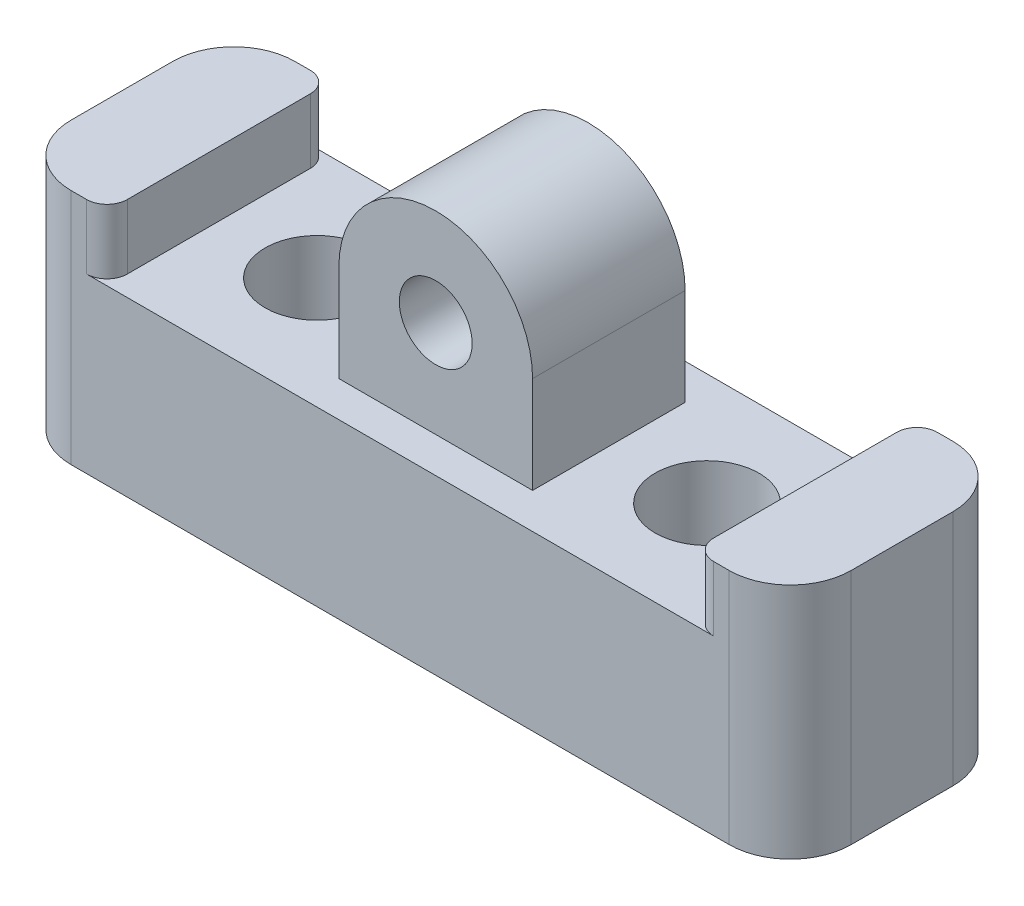
ISO-10303-21;
HEADER;
FILE_DESCRIPTION(('STEP AP214'),'2;1');
FILE_NAME('part.step','',(''),(''),'','','');
FILE_SCHEMA(('AUTOMOTIVE_DESIGN { 1 0 10303 214 1 1 1 1 }'));
ENDSEC;
DATA;
#1=APPLICATION_CONTEXT('core data for automotive mechanical design processes');
#2=APPLICATION_PROTOCOL_DEFINITION('international standard','automotive_design',2000,#1);
#3=PRODUCT_CONTEXT('',#1,'mechanical');
#4=PRODUCT('Part','Part','',(#3));
#5=PRODUCT_RELATED_PRODUCT_CATEGORY('part','',(#4));
#6=PRODUCT_DEFINITION_FORMATION('','',#4);
#7=PRODUCT_DEFINITION_CONTEXT('part definition',#1,'design');
#8=PRODUCT_DEFINITION('design','',#6,#7);
#9=PRODUCT_DEFINITION_SHAPE('','',#8);
#10=(LENGTH_UNIT() NAMED_UNIT(*) SI_UNIT(.MILLI.,.METRE.));
#11=(NAMED_UNIT(*) PLANE_ANGLE_UNIT() SI_UNIT($,.RADIAN.));
#12=(NAMED_UNIT(*) SI_UNIT($,.STERADIAN.) SOLID_ANGLE_UNIT());
#13=UNCERTAINTY_MEASURE_WITH_UNIT(LENGTH_MEASURE(1.E-05),#10,'distance_accuracy_value','');
#14=(GEOMETRIC_REPRESENTATION_CONTEXT(3) GLOBAL_UNCERTAINTY_ASSIGNED_CONTEXT((#13)) GLOBAL_UNIT_ASSIGNED_CONTEXT((#10,
#11,#12)) REPRESENTATION_CONTEXT('',''));
#15=CARTESIAN_POINT('',(0.,0.,0.));
#16=DIRECTION('',(0.,0.,1.));
#17=DIRECTION('',(1.,0.,0.));
#18=AXIS2_PLACEMENT_3D('',#15,#16,#17);
#19=CARTESIAN_POINT('',(0.,4.7625,-3.75));
#20=DIRECTION('',(0.,0.,1.));
#21=DIRECTION('',(1.,0.,0.));
#22=AXIS2_PLACEMENT_3D('',#19,#20,#21);
#23=CYLINDRICAL_SURFACE('',#22,1.7907);
#24=CARTESIAN_POINT('',(0.,4.7625,3.75));
#25=DIRECTION('',(0.,0.,1.));
#26=DIRECTION('',(1.,0.,0.));
#27=AXIS2_PLACEMENT_3D('',#24,#25,#26);
#28=CIRCLE('',#27,1.7907);
#29=CARTESIAN_POINT('',(1.7907,4.7625,3.75));
#30=VERTEX_POINT('',#29);
#31=EDGE_CURVE('E19',#30,#30,#28,.T.);
#32=ORIENTED_EDGE('',*,*,#31,.T.);
#33=EDGE_LOOP('',(#32));
#34=FACE_BOUND('',#33,.T.);
#35=CARTESIAN_POINT('',(0.,4.7625,-3.75));
#36=DIRECTION('',(0.,0.,1.));
#37=DIRECTION('',(1.,0.,0.));
#38=AXIS2_PLACEMENT_3D('',#35,#36,#37);
#39=CIRCLE('',#38,1.7907);
#40=CARTESIAN_POINT('',(1.7907,4.7625,-3.75));
#41=VERTEX_POINT('',#40);
#42=EDGE_CURVE('E172',#41,#41,#39,.T.);
#43=ORIENTED_EDGE('',*,*,#42,.F.);
#44=EDGE_LOOP('',(#43));
#45=FACE_BOUND('',#44,.T.);
#46=ADVANCED_FACE('F16',(#34,#45),#23,.F.);
#47=CARTESIAN_POINT('',(0.,4.7625,-3.75));
#48=DIRECTION('',(0.,0.,1.));
#49=DIRECTION('',(1.,0.,0.));
#50=AXIS2_PLACEMENT_3D('',#47,#48,#49);
#51=CYLINDRICAL_SURFACE('',#50,4.7625);
#52=CARTESIAN_POINT('',(0.,4.7625,-3.75));
#53=DIRECTION('',(0.,0.,1.));
#54=DIRECTION('',(1.,0.,0.));
#55=AXIS2_PLACEMENT_3D('',#52,#53,#54);
#56=CIRCLE('',#55,4.7625);
#57=CARTESIAN_POINT('',(-4.7625,4.7625,-3.75));
#58=VERTEX_POINT('',#57);
#59=CARTESIAN_POINT('',(4.7625,4.7625,-3.75));
#60=VERTEX_POINT('',#59);
#61=EDGE_CURVE('E259',#58,#60,#56,.F.);
#62=ORIENTED_EDGE('',*,*,#61,.F.);
#63=DIRECTION('',(0.,0.,1.));
#64=VECTOR('',#63,1.);
#65=CARTESIAN_POINT('',(-4.7625,4.7625,-3.75));
#66=LINE('',#65,#64);
#67=CARTESIAN_POINT('',(-4.7625,4.7625,3.75));
#68=VERTEX_POINT('',#67);
#69=EDGE_CURVE('E144',#68,#58,#66,.F.);
#70=ORIENTED_EDGE('',*,*,#69,.F.);
#71=CARTESIAN_POINT('',(0.,4.7625,3.75));
#72=DIRECTION('',(0.,0.,1.));
#73=DIRECTION('',(1.,0.,0.));
#74=AXIS2_PLACEMENT_3D('',#71,#72,#73);
#75=CIRCLE('',#74,4.7625);
#76=CARTESIAN_POINT('',(4.7625,4.7625,3.75));
#77=VERTEX_POINT('',#76);
#78=EDGE_CURVE('E147',#68,#77,#75,.F.);
#79=ORIENTED_EDGE('',*,*,#78,.T.);
#80=DIRECTION('',(0.,0.,-1.));
#81=VECTOR('',#80,1.);
#82=CARTESIAN_POINT('',(4.7625,4.7625,-3.75));
#83=LINE('',#82,#81);
#84=EDGE_CURVE('E151',#60,#77,#83,.F.);
#85=ORIENTED_EDGE('',*,*,#84,.F.);
#86=EDGE_LOOP('',(#62,#70,#79,#85));
#87=FACE_BOUND('',#86,.T.);
#88=ADVANCED_FACE('F149',(#87),#51,.T.);
#89=CARTESIAN_POINT('',(-4.7625,0.,-3.75));
#90=DIRECTION('',(-1.,0.,0.));
#91=DIRECTION('',(0.,0.,1.));
#92=AXIS2_PLACEMENT_3D('',#89,#90,#91);
#93=PLANE('',#92);
#94=DIRECTION('',(0.,1.,0.));
#95=VECTOR('',#94,1.);
#96=CARTESIAN_POINT('',(-4.7625,4.7625,-3.75));
#97=LINE('',#96,#95);
#98=CARTESIAN_POINT('',(-4.7625,0.,-3.75));
#99=VERTEX_POINT('',#98);
#100=EDGE_CURVE('E261',#99,#58,#97,.T.);
#101=ORIENTED_EDGE('',*,*,#100,.F.);
#102=DIRECTION('',(0.,0.,-1.));
#103=VECTOR('',#102,1.);
#104=CARTESIAN_POINT('',(-4.7625,0.,0.));
#105=LINE('',#104,#103);
#106=CARTESIAN_POINT('',(-4.7625,0.,3.75));
#107=VERTEX_POINT('',#106);
#108=EDGE_CURVE('E188',#99,#107,#105,.F.);
#109=ORIENTED_EDGE('',*,*,#108,.T.);
#110=DIRECTION('',(0.,1.,0.));
#111=VECTOR('',#110,1.);
#112=CARTESIAN_POINT('',(-4.7625,4.7625,3.75));
#113=LINE('',#112,#111);
#114=EDGE_CURVE('E156',#107,#68,#113,.T.);
#115=ORIENTED_EDGE('',*,*,#114,.T.);
#116=ORIENTED_EDGE('',*,*,#69,.T.);
#117=EDGE_LOOP('',(#101,#109,#115,#116));
#118=FACE_BOUND('',#117,.T.);
#119=ADVANCED_FACE('F595',(#118),#93,.T.);
#120=CARTESIAN_POINT('',(0.,4.7625,3.75));
#121=DIRECTION('',(0.,0.,-1.));
#122=DIRECTION('',(-1.,0.,0.));
#123=AXIS2_PLACEMENT_3D('',#120,#121,#122);
#124=PLANE('',#123);
#125=ORIENTED_EDGE('',*,*,#78,.F.);
#126=ORIENTED_EDGE('',*,*,#114,.F.);
#127=DIRECTION('',(1.,0.,0.));
#128=VECTOR('',#127,1.);
#129=CARTESIAN_POINT('',(0.,0.,3.75));
#130=LINE('',#129,#128);
#131=CARTESIAN_POINT('',(4.7625,0.,3.75));
#132=VERTEX_POINT('',#131);
#133=EDGE_CURVE('E163',#107,#132,#130,.T.);
#134=ORIENTED_EDGE('',*,*,#133,.T.);
#135=DIRECTION('',(0.,1.,0.));
#136=VECTOR('',#135,1.);
#137=CARTESIAN_POINT('',(4.7625,4.7625,3.75));
#138=LINE('',#137,#136);
#139=EDGE_CURVE('E155',#77,#132,#138,.F.);
#140=ORIENTED_EDGE('',*,*,#139,.F.);
#141=EDGE_LOOP('',(#125,#126,#134,#140));
#142=FACE_BOUND('',#141,.T.);
#143=ORIENTED_EDGE('',*,*,#31,.F.);
#144=EDGE_LOOP('',(#143));
#145=FACE_BOUND('',#144,.T.);
#146=ADVANCED_FACE('F159',(#142,#145),#124,.F.);
#147=CARTESIAN_POINT('',(4.7625,4.7625,-3.75));
#148=DIRECTION('',(1.,0.,0.));
#149=DIRECTION('',(0.,0.,-1.));
#150=AXIS2_PLACEMENT_3D('',#147,#148,#149);
#151=PLANE('',#150);
#152=DIRECTION('',(0.,1.,0.));
#153=VECTOR('',#152,1.);
#154=CARTESIAN_POINT('',(4.7625,4.7625,-3.75));
#155=LINE('',#154,#153);
#156=CARTESIAN_POINT('',(4.7625,0.,-3.75));
#157=VERTEX_POINT('',#156);
#158=EDGE_CURVE('E170',#60,#157,#155,.F.);
#159=ORIENTED_EDGE('',*,*,#158,.F.);
#160=ORIENTED_EDGE('',*,*,#84,.T.);
#161=ORIENTED_EDGE('',*,*,#139,.T.);
#162=DIRECTION('',(0.,0.,-1.));
#163=VECTOR('',#162,1.);
#164=CARTESIAN_POINT('',(4.7625,0.,0.));
#165=LINE('',#164,#163);
#166=EDGE_CURVE('E180',#132,#157,#165,.T.);
#167=ORIENTED_EDGE('',*,*,#166,.T.);
#168=EDGE_LOOP('',(#159,#160,#161,#167));
#169=FACE_BOUND('',#168,.T.);
#170=ADVANCED_FACE('F168',(#169),#151,.T.);
#171=CARTESIAN_POINT('',(0.,4.7625,-3.75));
#172=DIRECTION('',(0.,0.,-1.));
#173=DIRECTION('',(-1.,0.,0.));
#174=AXIS2_PLACEMENT_3D('',#171,#172,#173);
#175=PLANE('',#174);
#176=ORIENTED_EDGE('',*,*,#100,.T.);
#177=ORIENTED_EDGE('',*,*,#61,.T.);
#178=ORIENTED_EDGE('',*,*,#158,.T.);
#179=DIRECTION('',(1.,0.,0.));
#180=VECTOR('',#179,1.);
#181=CARTESIAN_POINT('',(0.,0.,-3.75));
#182=LINE('',#181,#180);
#183=EDGE_CURVE('E182',#157,#99,#182,.F.);
#184=ORIENTED_EDGE('',*,*,#183,.T.);
#185=EDGE_LOOP('',(#176,#177,#178,#184));
#186=FACE_BOUND('',#185,.T.);
#187=ORIENTED_EDGE('',*,*,#42,.T.);
#188=EDGE_LOOP('',(#187));
#189=FACE_BOUND('',#188,.T.);
#190=ADVANCED_FACE('F573',(#186,#189),#175,.T.);
#191=CARTESIAN_POINT('',(14.4145,18.3367179098367,5.5));
#192=DIRECTION('',(-1.,0.,0.));
#193=DIRECTION('',(0.,0.,1.));
#194=AXIS2_PLACEMENT_3D('',#191,#192,#193);
#195=PLANE('',#194);
#196=DIRECTION('',(0.,0.,-1.));
#197=VECTOR('',#196,1.);
#198=CARTESIAN_POINT('',(14.4145,0.,0.));
#199=LINE('',#198,#197);
#200=CARTESIAN_POINT('',(14.4145,0.,-4.499999968));
#201=VERTEX_POINT('',#200);
#202=CARTESIAN_POINT('',(14.4145,0.,4.499999968));
#203=VERTEX_POINT('',#202);
#204=EDGE_CURVE('E239',#201,#203,#199,.F.);
#205=ORIENTED_EDGE('',*,*,#204,.T.);
#206=DIRECTION('',(0.,1.,0.));
#207=VECTOR('',#206,1.);
#208=CARTESIAN_POINT('',(14.4145,-8.5,4.499999968));
#209=LINE('',#208,#207);
#210=CARTESIAN_POINT('',(14.4145,3.175,4.499999968));
#211=VERTEX_POINT('',#210);
#212=EDGE_CURVE('E251',#211,#203,#209,.F.);
#213=ORIENTED_EDGE('',*,*,#212,.F.);
#214=DIRECTION('',(0.,0.,-1.));
#215=VECTOR('',#214,1.);
#216=CARTESIAN_POINT('',(14.4145,3.175,0.));
#217=LINE('',#216,#215);
#218=CARTESIAN_POINT('',(14.4145,3.175,-4.499999968));
#219=VERTEX_POINT('',#218);
#220=EDGE_CURVE('E258',#211,#219,#217,.T.);
#221=ORIENTED_EDGE('',*,*,#220,.T.);
#222=DIRECTION('',(0.,1.,0.));
#223=VECTOR('',#222,1.);
#224=CARTESIAN_POINT('',(14.4145,18.3367179098367,-4.499999968));
#225=LINE('',#224,#223);
#226=EDGE_CURVE('E260',#201,#219,#225,.T.);
#227=ORIENTED_EDGE('',*,*,#226,.F.);
#228=EDGE_LOOP('',(#205,#213,#221,#227));
#229=FACE_BOUND('',#228,.T.);
#230=ADVANCED_FACE('F345',(#229),#195,.T.);
#231=CARTESIAN_POINT('',(-14.4145,18.3367179098367,5.5));
#232=DIRECTION('',(1.,0.,0.));
#233=DIRECTION('',(0.,0.,-1.));
#234=AXIS2_PLACEMENT_3D('',#231,#232,#233);
#235=PLANE('',#234);
#236=DIRECTION('',(0.,0.,-1.));
#237=VECTOR('',#236,1.);
#238=CARTESIAN_POINT('',(-14.4145,3.175,0.));
#239=LINE('',#238,#237);
#240=CARTESIAN_POINT('',(-14.4145,3.175,-4.499999968));
#241=VERTEX_POINT('',#240);
#242=CARTESIAN_POINT('',(-14.4145,3.175,4.499999968));
#243=VERTEX_POINT('',#242);
#244=EDGE_CURVE('E248',#241,#243,#239,.F.);
#245=ORIENTED_EDGE('',*,*,#244,.T.);
#246=DIRECTION('',(0.,1.,0.));
#247=VECTOR('',#246,1.);
#248=CARTESIAN_POINT('',(-14.4145,18.3367179098367,4.499999968));
#249=LINE('',#248,#247);
#250=CARTESIAN_POINT('',(-14.4145,0.,4.499999968));
#251=VERTEX_POINT('',#250);
#252=EDGE_CURVE('E255',#251,#243,#249,.T.);
#253=ORIENTED_EDGE('',*,*,#252,.F.);
#254=DIRECTION('',(0.,0.,-1.));
#255=VECTOR('',#254,1.);
#256=CARTESIAN_POINT('',(-14.4145,0.,0.));
#257=LINE('',#256,#255);
#258=CARTESIAN_POINT('',(-14.4145,0.,-4.499999968));
#259=VERTEX_POINT('',#258);
#260=EDGE_CURVE('E233',#251,#259,#257,.T.);
#261=ORIENTED_EDGE('',*,*,#260,.T.);
#262=DIRECTION('',(0.,1.,0.));
#263=VECTOR('',#262,1.);
#264=CARTESIAN_POINT('',(-14.4145,-8.5,-4.499999968));
#265=LINE('',#264,#263);
#266=EDGE_CURVE('E265',#241,#259,#265,.F.);
#267=ORIENTED_EDGE('',*,*,#266,.F.);
#268=EDGE_LOOP('',(#245,#253,#261,#267));
#269=FACE_BOUND('',#268,.T.);
#270=ADVANCED_FACE('F366',(#269),#235,.T.);
#271=CARTESIAN_POINT('',(15.414500032,18.3367179098367,-4.499999968));
#272=DIRECTION('',(0.,1.,0.));
#273=DIRECTION('',(0.,0.,1.));
#274=AXIS2_PLACEMENT_3D('',#271,#272,#273);
#275=CYLINDRICAL_SURFACE('',#274,1.000000032);
#276=CARTESIAN_POINT('',(15.414500032,0.,-4.499999968));
#277=DIRECTION('',(0.,1.,0.));
#278=DIRECTION('',(0.,0.,1.));
#279=AXIS2_PLACEMENT_3D('',#276,#277,#278);
#280=CIRCLE('',#279,1.000000032);
#281=CARTESIAN_POINT('',(15.414500032,0.,-5.5));
#282=VERTEX_POINT('',#281);
#283=EDGE_CURVE('E240',#282,#201,#280,.T.);
#284=ORIENTED_EDGE('',*,*,#283,.T.);
#285=ORIENTED_EDGE('',*,*,#226,.T.);
#286=CARTESIAN_POINT('',(15.414500032,3.175,-4.499999968));
#287=DIRECTION('',(0.,1.,0.));
#288=DIRECTION('',(0.,0.,1.));
#289=AXIS2_PLACEMENT_3D('',#286,#287,#288);
#290=CIRCLE('',#289,1.000000032);
#291=CARTESIAN_POINT('',(15.414500032,3.175,-5.5));
#292=VERTEX_POINT('',#291);
#293=EDGE_CURVE('E256',#219,#292,#290,.F.);
#294=ORIENTED_EDGE('',*,*,#293,.T.);
#295=DIRECTION('',(0.,1.,0.));
#296=VECTOR('',#295,1.);
#297=CARTESIAN_POINT('',(15.414500032,-8.5,-5.5));
#298=LINE('',#297,#296);
#299=EDGE_CURVE('E311',#292,#282,#298,.F.);
#300=ORIENTED_EDGE('',*,*,#299,.T.);
#301=EDGE_LOOP('',(#284,#285,#294,#300));
#302=FACE_BOUND('',#301,.T.);
#303=ADVANCED_FACE('F347',(#302),#275,.T.);
#304=CARTESIAN_POINT('',(-15.414500032,-8.5,-4.499999968));
#305=DIRECTION('',(0.,1.,0.));
#306=DIRECTION('',(0.,0.,1.));
#307=AXIS2_PLACEMENT_3D('',#304,#305,#306);
#308=CYLINDRICAL_SURFACE('',#307,1.000000032);
#309=CARTESIAN_POINT('',(-15.414500032,0.,-4.499999968));
#310=DIRECTION('',(0.,1.,0.));
#311=DIRECTION('',(0.,0.,1.));
#312=AXIS2_PLACEMENT_3D('',#309,#310,#311);
#313=CIRCLE('',#312,1.000000032);
#314=CARTESIAN_POINT('',(-15.414500032,0.,-5.5));
#315=VERTEX_POINT('',#314);
#316=EDGE_CURVE('E243',#259,#315,#313,.T.);
#317=ORIENTED_EDGE('',*,*,#316,.T.);
#318=DIRECTION('',(0.,1.,0.));
#319=VECTOR('',#318,1.);
#320=CARTESIAN_POINT('',(-15.414500032,-8.5,-5.5));
#321=LINE('',#320,#319);
#322=CARTESIAN_POINT('',(-15.414500032,3.175,-5.5));
#323=VERTEX_POINT('',#322);
#324=EDGE_CURVE('E313',#315,#323,#321,.T.);
#325=ORIENTED_EDGE('',*,*,#324,.T.);
#326=CARTESIAN_POINT('',(-15.414500032,3.175,-4.499999968));
#327=DIRECTION('',(0.,1.,0.));
#328=DIRECTION('',(0.,0.,1.));
#329=AXIS2_PLACEMENT_3D('',#326,#327,#328);
#330=CIRCLE('',#329,1.000000032);
#331=EDGE_CURVE('E245',#323,#241,#330,.F.);
#332=ORIENTED_EDGE('',*,*,#331,.T.);
#333=ORIENTED_EDGE('',*,*,#266,.T.);
#334=EDGE_LOOP('',(#317,#325,#332,#333));
#335=FACE_BOUND('',#334,.T.);
#336=ADVANCED_FACE('F359',(#335),#308,.T.);
#337=CARTESIAN_POINT('',(0.,3.175,0.));
#338=DIRECTION('',(0.,-1.,0.));
#339=DIRECTION('',(0.,0.,-1.));
#340=AXIS2_PLACEMENT_3D('',#337,#338,#339);
#341=PLANE('',#340);
#342=ORIENTED_EDGE('',*,*,#293,.F.);
#343=ORIENTED_EDGE('',*,*,#220,.F.);
#344=CARTESIAN_POINT('',(15.414500032,3.175,4.499999968));
#345=DIRECTION('',(0.,1.,0.));
#346=DIRECTION('',(0.,0.,1.));
#347=AXIS2_PLACEMENT_3D('',#344,#345,#346);
#348=CIRCLE('',#347,1.000000032);
#349=CARTESIAN_POINT('',(15.414500032,3.175,5.5));
#350=VERTEX_POINT('',#349);
#351=EDGE_CURVE('E252',#350,#211,#348,.F.);
#352=ORIENTED_EDGE('',*,*,#351,.F.);
#353=DIRECTION('',(1.,0.,0.));
#354=VECTOR('',#353,1.);
#355=CARTESIAN_POINT('',(0.,3.175,5.5));
#356=LINE('',#355,#354);
#357=CARTESIAN_POINT('',(16.177,3.175,5.5));
#358=VERTEX_POINT('',#357);
#359=EDGE_CURVE('E306',#358,#350,#356,.F.);
#360=ORIENTED_EDGE('',*,*,#359,.F.);
#361=CARTESIAN_POINT('',(16.177,3.175,2.5));
#362=DIRECTION('',(0.,1.,0.));
#363=DIRECTION('',(0.,0.,1.));
#364=AXIS2_PLACEMENT_3D('',#361,#362,#363);
#365=CIRCLE('',#364,3.);
#366=CARTESIAN_POINT('',(19.177,3.175,2.5));
#367=VERTEX_POINT('',#366);
#368=EDGE_CURVE('E217',#367,#358,#365,.F.);
#369=ORIENTED_EDGE('',*,*,#368,.F.);
#370=DIRECTION('',(0.,0.,-1.));
#371=VECTOR('',#370,1.);
#372=CARTESIAN_POINT('',(19.177,3.175,5.5));
#373=LINE('',#372,#371);
#374=CARTESIAN_POINT('',(19.177,3.175,-2.5));
#375=VERTEX_POINT('',#374);
#376=EDGE_CURVE('E221',#375,#367,#373,.F.);
#377=ORIENTED_EDGE('',*,*,#376,.F.);
#378=CARTESIAN_POINT('',(16.177,3.175,-2.5));
#379=DIRECTION('',(0.,1.,0.));
#380=DIRECTION('',(0.,0.,1.));
#381=AXIS2_PLACEMENT_3D('',#378,#379,#380);
#382=CIRCLE('',#381,3.);
#383=CARTESIAN_POINT('',(16.177,3.175,-5.5));
#384=VERTEX_POINT('',#383);
#385=EDGE_CURVE('E222',#384,#375,#382,.F.);
#386=ORIENTED_EDGE('',*,*,#385,.F.);
#387=DIRECTION('',(1.,0.,0.));
#388=VECTOR('',#387,1.);
#389=CARTESIAN_POINT('',(14.4145,3.175,-5.5));
#390=LINE('',#389,#388);
#391=EDGE_CURVE('E308',#384,#292,#390,.F.);
#392=ORIENTED_EDGE('',*,*,#391,.T.);
#393=EDGE_LOOP('',(#342,#343,#352,#360,#369,#377,#386,#392));
#394=FACE_BOUND('',#393,.T.);
#395=ADVANCED_FACE('F344',(#394),#341,.F.);
#396=CARTESIAN_POINT('',(-15.414500032,18.3367179098367,4.499999968));
#397=DIRECTION('',(0.,1.,0.));
#398=DIRECTION('',(0.,0.,1.));
#399=AXIS2_PLACEMENT_3D('',#396,#397,#398);
#400=CYLINDRICAL_SURFACE('',#399,1.000000032);
#401=CARTESIAN_POINT('',(-15.414500032,0.,4.499999968));
#402=DIRECTION('',(0.,1.,0.));
#403=DIRECTION('',(0.,0.,1.));
#404=AXIS2_PLACEMENT_3D('',#401,#402,#403);
#405=CIRCLE('',#404,1.000000032);
#406=CARTESIAN_POINT('',(-15.414500032,0.,5.5));
#407=VERTEX_POINT('',#406);
#408=EDGE_CURVE('E234',#407,#251,#405,.T.);
#409=ORIENTED_EDGE('',*,*,#408,.T.);
#410=ORIENTED_EDGE('',*,*,#252,.T.);
#411=CARTESIAN_POINT('',(-15.414500032,3.175,4.499999968));
#412=DIRECTION('',(0.,1.,0.));
#413=DIRECTION('',(0.,0.,1.));
#414=AXIS2_PLACEMENT_3D('',#411,#412,#413);
#415=CIRCLE('',#414,1.000000032);
#416=CARTESIAN_POINT('',(-15.414500032,3.175,5.5));
#417=VERTEX_POINT('',#416);
#418=EDGE_CURVE('E249',#243,#417,#415,.F.);
#419=ORIENTED_EDGE('',*,*,#418,.T.);
#420=DIRECTION('',(0.,1.,0.));
#421=VECTOR('',#420,1.);
#422=CARTESIAN_POINT('',(-15.414500032,-8.5,5.5));
#423=LINE('',#422,#421);
#424=EDGE_CURVE('E294',#417,#407,#423,.F.);
#425=ORIENTED_EDGE('',*,*,#424,.T.);
#426=EDGE_LOOP('',(#409,#410,#419,#425));
#427=FACE_BOUND('',#426,.T.);
#428=ADVANCED_FACE('F364',(#427),#400,.T.);
#429=CARTESIAN_POINT('',(15.414500032,-8.5,4.499999968));
#430=DIRECTION('',(0.,1.,0.));
#431=DIRECTION('',(0.,0.,1.));
#432=AXIS2_PLACEMENT_3D('',#429,#430,#431);
#433=CYLINDRICAL_SURFACE('',#432,1.000000032);
#434=CARTESIAN_POINT('',(15.414500032,0.,4.499999968));
#435=DIRECTION('',(0.,1.,0.));
#436=DIRECTION('',(0.,0.,1.));
#437=AXIS2_PLACEMENT_3D('',#434,#435,#436);
#438=CIRCLE('',#437,1.000000032);
#439=CARTESIAN_POINT('',(15.414500032,0.,5.5));
#440=VERTEX_POINT('',#439);
#441=EDGE_CURVE('E237',#203,#440,#438,.T.);
#442=ORIENTED_EDGE('',*,*,#441,.T.);
#443=DIRECTION('',(0.,1.,0.));
#444=VECTOR('',#443,1.);
#445=CARTESIAN_POINT('',(15.414500032,-8.5,5.5));
#446=LINE('',#445,#444);
#447=EDGE_CURVE('E216',#440,#350,#446,.T.);
#448=ORIENTED_EDGE('',*,*,#447,.T.);
#449=ORIENTED_EDGE('',*,*,#351,.T.);
#450=ORIENTED_EDGE('',*,*,#212,.T.);
#451=EDGE_LOOP('',(#442,#448,#449,#450));
#452=FACE_BOUND('',#451,.T.);
#453=ADVANCED_FACE('F326',(#452),#433,.T.);
#454=CARTESIAN_POINT('',(0.,3.175,0.));
#455=DIRECTION('',(0.,-1.,0.));
#456=DIRECTION('',(0.,0.,-1.));
#457=AXIS2_PLACEMENT_3D('',#454,#455,#456);
#458=PLANE('',#457);
#459=ORIENTED_EDGE('',*,*,#331,.F.);
#460=DIRECTION('',(1.,0.,0.));
#461=VECTOR('',#460,1.);
#462=CARTESIAN_POINT('',(14.4145,3.175,-5.5));
#463=LINE('',#462,#461);
#464=CARTESIAN_POINT('',(-16.177,3.175,-5.5));
#465=VERTEX_POINT('',#464);
#466=EDGE_CURVE('E225',#323,#465,#463,.F.);
#467=ORIENTED_EDGE('',*,*,#466,.T.);
#468=CARTESIAN_POINT('',(-16.177,3.175,-2.5));
#469=DIRECTION('',(0.,1.,0.));
#470=DIRECTION('',(0.,0.,1.));
#471=AXIS2_PLACEMENT_3D('',#468,#469,#470);
#472=CIRCLE('',#471,3.);
#473=CARTESIAN_POINT('',(-19.177,3.175,-2.5));
#474=VERTEX_POINT('',#473);
#475=EDGE_CURVE('E226',#474,#465,#472,.F.);
#476=ORIENTED_EDGE('',*,*,#475,.F.);
#477=DIRECTION('',(0.,0.,1.));
#478=VECTOR('',#477,1.);
#479=CARTESIAN_POINT('',(-19.177,3.175,5.5));
#480=LINE('',#479,#478);
#481=CARTESIAN_POINT('',(-19.177,3.175,2.5));
#482=VERTEX_POINT('',#481);
#483=EDGE_CURVE('E229',#482,#474,#480,.F.);
#484=ORIENTED_EDGE('',*,*,#483,.F.);
#485=CARTESIAN_POINT('',(-16.177,3.175,2.5));
#486=DIRECTION('',(0.,1.,0.));
#487=DIRECTION('',(0.,0.,1.));
#488=AXIS2_PLACEMENT_3D('',#485,#486,#487);
#489=CIRCLE('',#488,3.);
#490=CARTESIAN_POINT('',(-16.177,3.175,5.5));
#491=VERTEX_POINT('',#490);
#492=EDGE_CURVE('E212',#491,#482,#489,.F.);
#493=ORIENTED_EDGE('',*,*,#492,.F.);
#494=DIRECTION('',(-1.,0.,0.));
#495=VECTOR('',#494,1.);
#496=CARTESIAN_POINT('',(14.4145,3.175,5.5));
#497=LINE('',#496,#495);
#498=EDGE_CURVE('E297',#491,#417,#497,.F.);
#499=ORIENTED_EDGE('',*,*,#498,.T.);
#500=ORIENTED_EDGE('',*,*,#418,.F.);
#501=ORIENTED_EDGE('',*,*,#244,.F.);
#502=EDGE_LOOP('',(#459,#467,#476,#484,#493,#499,#500,#501));
#503=FACE_BOUND('',#502,.T.);
#504=ADVANCED_FACE('F361',(#503),#458,.F.);
#505=CARTESIAN_POINT('',(0.,0.,0.));
#506=DIRECTION('',(0.,-1.,0.));
#507=DIRECTION('',(0.,0.,-1.));
#508=AXIS2_PLACEMENT_3D('',#505,#506,#507);
#509=PLANE('',#508);
#510=CARTESIAN_POINT('',(9.5885,0.,0.));
#511=DIRECTION('',(0.,1.,0.));
#512=DIRECTION('',(0.,0.,1.));
#513=AXIS2_PLACEMENT_3D('',#510,#511,#512);
#514=CIRCLE('',#513,2.5527);
#515=CARTESIAN_POINT('',(9.5885,0.,2.5527));
#516=VERTEX_POINT('',#515);
#517=EDGE_CURVE('E209',#516,#516,#514,.F.);
#518=ORIENTED_EDGE('',*,*,#517,.T.);
#519=EDGE_LOOP('',(#518));
#520=FACE_BOUND('',#519,.T.);
#521=CARTESIAN_POINT('',(-9.5885,0.,0.));
#522=DIRECTION('',(0.,1.,0.));
#523=DIRECTION('',(0.,0.,1.));
#524=AXIS2_PLACEMENT_3D('',#521,#522,#523);
#525=CIRCLE('',#524,2.5527);
#526=CARTESIAN_POINT('',(-9.5885,0.,2.55269999999999));
#527=VERTEX_POINT('',#526);
#528=EDGE_CURVE('E230',#527,#527,#525,.F.);
#529=ORIENTED_EDGE('',*,*,#528,.T.);
#530=EDGE_LOOP('',(#529));
#531=FACE_BOUND('',#530,.T.);
#532=ORIENTED_EDGE('',*,*,#408,.F.);
#533=DIRECTION('',(-1.,0.,0.));
#534=VECTOR('',#533,1.);
#535=CARTESIAN_POINT('',(14.4145,0.,5.5));
#536=LINE('',#535,#534);
#537=EDGE_CURVE('E296',#407,#440,#536,.F.);
#538=ORIENTED_EDGE('',*,*,#537,.T.);
#539=ORIENTED_EDGE('',*,*,#441,.F.);
#540=ORIENTED_EDGE('',*,*,#204,.F.);
#541=ORIENTED_EDGE('',*,*,#283,.F.);
#542=DIRECTION('',(1.,0.,0.));
#543=VECTOR('',#542,1.);
#544=CARTESIAN_POINT('',(14.4145,0.,-5.5));
#545=LINE('',#544,#543);
#546=EDGE_CURVE('E315',#282,#315,#545,.F.);
#547=ORIENTED_EDGE('',*,*,#546,.T.);
#548=ORIENTED_EDGE('',*,*,#316,.F.);
#549=ORIENTED_EDGE('',*,*,#260,.F.);
#550=EDGE_LOOP('',(#532,#538,#539,#540,#541,#547,#548,#549));
#551=FACE_BOUND('',#550,.T.);
#552=ORIENTED_EDGE('',*,*,#166,.F.);
#553=ORIENTED_EDGE('',*,*,#133,.F.);
#554=ORIENTED_EDGE('',*,*,#108,.F.);
#555=ORIENTED_EDGE('',*,*,#183,.F.);
#556=EDGE_LOOP('',(#552,#553,#554,#555));
#557=FACE_BOUND('',#556,.T.);
#558=ADVANCED_FACE('F332',(#520,#531,#551,#557),#509,.F.);
#559=CARTESIAN_POINT('',(-9.5885,-8.5,0.));
#560=DIRECTION('',(0.,1.,0.));
#561=DIRECTION('',(0.,0.,1.));
#562=AXIS2_PLACEMENT_3D('',#559,#560,#561);
#563=CYLINDRICAL_SURFACE('',#562,2.5527);
#564=CARTESIAN_POINT('',(-9.5885,-8.5,0.));
#565=DIRECTION('',(0.,1.,0.));
#566=DIRECTION('',(0.,0.,1.));
#567=AXIS2_PLACEMENT_3D('',#564,#565,#566);
#568=CIRCLE('',#567,2.5527);
#569=CARTESIAN_POINT('',(-9.5885,-8.5,2.55269999999999));
#570=VERTEX_POINT('',#569);
#571=EDGE_CURVE('E206',#570,#570,#568,.T.);
#572=ORIENTED_EDGE('',*,*,#571,.F.);
#573=EDGE_LOOP('',(#572));
#574=FACE_BOUND('',#573,.T.);
#575=ORIENTED_EDGE('',*,*,#528,.F.);
#576=EDGE_LOOP('',(#575));
#577=FACE_BOUND('',#576,.T.);
#578=ADVANCED_FACE('F500',(#574,#577),#563,.F.);
#579=CARTESIAN_POINT('',(-19.177,18.3367179098367,5.5));
#580=DIRECTION('',(-1.,0.,0.));
#581=DIRECTION('',(0.,0.,1.));
#582=AXIS2_PLACEMENT_3D('',#579,#580,#581);
#583=PLANE('',#582);
#584=DIRECTION('',(0.,0.,-1.));
#585=VECTOR('',#584,1.);
#586=CARTESIAN_POINT('',(-19.177,-8.5,0.));
#587=LINE('',#586,#585);
#588=CARTESIAN_POINT('',(-19.177,-8.5,2.5));
#589=VERTEX_POINT('',#588);
#590=CARTESIAN_POINT('',(-19.177,-8.5,-2.5));
#591=VERTEX_POINT('',#590);
#592=EDGE_CURVE('E205',#589,#591,#587,.T.);
#593=ORIENTED_EDGE('',*,*,#592,.F.);
#594=DIRECTION('',(0.,1.,0.));
#595=VECTOR('',#594,1.);
#596=CARTESIAN_POINT('',(-19.177,-8.5,2.5));
#597=LINE('',#596,#595);
#598=EDGE_CURVE('E215',#482,#589,#597,.F.);
#599=ORIENTED_EDGE('',*,*,#598,.F.);
#600=ORIENTED_EDGE('',*,*,#483,.T.);
#601=DIRECTION('',(0.,1.,0.));
#602=VECTOR('',#601,1.);
#603=CARTESIAN_POINT('',(-19.177,18.3367179098367,-2.5));
#604=LINE('',#603,#602);
#605=EDGE_CURVE('E228',#591,#474,#604,.T.);
#606=ORIENTED_EDGE('',*,*,#605,.F.);
#607=EDGE_LOOP('',(#593,#599,#600,#606));
#608=FACE_BOUND('',#607,.T.);
#609=ADVANCED_FACE('F390',(#608),#583,.T.);
#610=CARTESIAN_POINT('',(-16.177,18.3367179098367,-2.5));
#611=DIRECTION('',(0.,1.,0.));
#612=DIRECTION('',(0.,0.,1.));
#613=AXIS2_PLACEMENT_3D('',#610,#611,#612);
#614=CYLINDRICAL_SURFACE('',#613,3.);
#615=CARTESIAN_POINT('',(-16.177,-8.5,-2.5));
#616=DIRECTION('',(0.,1.,0.));
#617=DIRECTION('',(0.,0.,1.));
#618=AXIS2_PLACEMENT_3D('',#615,#616,#617);
#619=CIRCLE('',#618,3.);
#620=CARTESIAN_POINT('',(-16.177,-8.5,-5.5));
#621=VERTEX_POINT('',#620);
#622=EDGE_CURVE('E202',#591,#621,#619,.F.);
#623=ORIENTED_EDGE('',*,*,#622,.F.);
#624=ORIENTED_EDGE('',*,*,#605,.T.);
#625=ORIENTED_EDGE('',*,*,#475,.T.);
#626=DIRECTION('',(0.,1.,0.));
#627=VECTOR('',#626,1.);
#628=CARTESIAN_POINT('',(-16.177,-8.5,-5.5));
#629=LINE('',#628,#627);
#630=EDGE_CURVE('E312',#465,#621,#629,.F.);
#631=ORIENTED_EDGE('',*,*,#630,.T.);
#632=EDGE_LOOP('',(#623,#624,#625,#631));
#633=FACE_BOUND('',#632,.T.);
#634=ADVANCED_FACE('F386',(#633),#614,.T.);
#635=CARTESIAN_POINT('',(14.4145,-8.5,-5.5));
#636=DIRECTION('',(0.,0.,1.));
#637=DIRECTION('',(1.,0.,0.));
#638=AXIS2_PLACEMENT_3D('',#635,#636,#637);
#639=PLANE('',#638);
#640=ORIENTED_EDGE('',*,*,#324,.F.);
#641=ORIENTED_EDGE('',*,*,#546,.F.);
#642=ORIENTED_EDGE('',*,*,#299,.F.);
#643=ORIENTED_EDGE('',*,*,#391,.F.);
#644=DIRECTION('',(0.,1.,0.));
#645=VECTOR('',#644,1.);
#646=CARTESIAN_POINT('',(16.177,-8.5,-5.5));
#647=LINE('',#646,#645);
#648=CARTESIAN_POINT('',(16.177,-8.5,-5.5));
#649=VERTEX_POINT('',#648);
#650=EDGE_CURVE('E224',#649,#384,#647,.T.);
#651=ORIENTED_EDGE('',*,*,#650,.F.);
#652=DIRECTION('',(1.,0.,0.));
#653=VECTOR('',#652,1.);
#654=CARTESIAN_POINT('',(0.,-8.5,-5.5));
#655=LINE('',#654,#653);
#656=EDGE_CURVE('E201',#621,#649,#655,.T.);
#657=ORIENTED_EDGE('',*,*,#656,.F.);
#658=ORIENTED_EDGE('',*,*,#630,.F.);
#659=ORIENTED_EDGE('',*,*,#466,.F.);
#660=EDGE_LOOP('',(#640,#641,#642,#643,#651,#657,#658,#659));
#661=FACE_BOUND('',#660,.T.);
#662=ADVANCED_FACE('F353',(#661),#639,.F.);
#663=CARTESIAN_POINT('',(16.177,-8.5,-2.5));
#664=DIRECTION('',(0.,1.,0.));
#665=DIRECTION('',(0.,0.,1.));
#666=AXIS2_PLACEMENT_3D('',#663,#664,#665);
#667=CYLINDRICAL_SURFACE('',#666,3.);
#668=CARTESIAN_POINT('',(16.177,-8.5,-2.5));
#669=DIRECTION('',(0.,1.,0.));
#670=DIRECTION('',(0.,0.,1.));
#671=AXIS2_PLACEMENT_3D('',#668,#669,#670);
#672=CIRCLE('',#671,3.);
#673=CARTESIAN_POINT('',(19.177,-8.5,-2.5));
#674=VERTEX_POINT('',#673);
#675=EDGE_CURVE('E198',#649,#674,#672,.F.);
#676=ORIENTED_EDGE('',*,*,#675,.F.);
#677=ORIENTED_EDGE('',*,*,#650,.T.);
#678=ORIENTED_EDGE('',*,*,#385,.T.);
#679=DIRECTION('',(0.,1.,0.));
#680=VECTOR('',#679,1.);
#681=CARTESIAN_POINT('',(19.177,18.3367179098367,-2.5));
#682=LINE('',#681,#680);
#683=EDGE_CURVE('E304',#674,#375,#682,.T.);
#684=ORIENTED_EDGE('',*,*,#683,.F.);
#685=EDGE_LOOP('',(#676,#677,#678,#684));
#686=FACE_BOUND('',#685,.T.);
#687=ADVANCED_FACE('F412',(#686),#667,.T.);
#688=CARTESIAN_POINT('',(19.177,18.3367179098367,5.5));
#689=DIRECTION('',(1.,0.,0.));
#690=DIRECTION('',(0.,0.,-1.));
#691=AXIS2_PLACEMENT_3D('',#688,#689,#690);
#692=PLANE('',#691);
#693=ORIENTED_EDGE('',*,*,#376,.T.);
#694=DIRECTION('',(0.,1.,0.));
#695=VECTOR('',#694,1.);
#696=CARTESIAN_POINT('',(19.177,18.3367179098367,2.5));
#697=LINE('',#696,#695);
#698=CARTESIAN_POINT('',(19.177,-8.5,2.5));
#699=VERTEX_POINT('',#698);
#700=EDGE_CURVE('E220',#699,#367,#697,.T.);
#701=ORIENTED_EDGE('',*,*,#700,.F.);
#702=DIRECTION('',(0.,0.,-1.));
#703=VECTOR('',#702,1.);
#704=CARTESIAN_POINT('',(19.177,-8.5,0.));
#705=LINE('',#704,#703);
#706=EDGE_CURVE('E197',#674,#699,#705,.F.);
#707=ORIENTED_EDGE('',*,*,#706,.F.);
#708=ORIENTED_EDGE('',*,*,#683,.T.);
#709=EDGE_LOOP('',(#693,#701,#707,#708));
#710=FACE_BOUND('',#709,.T.);
#711=ADVANCED_FACE('F408',(#710),#692,.T.);
#712=CARTESIAN_POINT('',(16.177,18.3367179098367,2.5));
#713=DIRECTION('',(0.,1.,0.));
#714=DIRECTION('',(0.,0.,1.));
#715=AXIS2_PLACEMENT_3D('',#712,#713,#714);
#716=CYLINDRICAL_SURFACE('',#715,3.);
#717=CARTESIAN_POINT('',(16.177,-8.5,2.5));
#718=DIRECTION('',(0.,1.,0.));
#719=DIRECTION('',(0.,0.,1.));
#720=AXIS2_PLACEMENT_3D('',#717,#718,#719);
#721=CIRCLE('',#720,3.);
#722=CARTESIAN_POINT('',(16.177,-8.5,5.5));
#723=VERTEX_POINT('',#722);
#724=EDGE_CURVE('E194',#699,#723,#721,.F.);
#725=ORIENTED_EDGE('',*,*,#724,.F.);
#726=ORIENTED_EDGE('',*,*,#700,.T.);
#727=ORIENTED_EDGE('',*,*,#368,.T.);
#728=DIRECTION('',(0.,1.,0.));
#729=VECTOR('',#728,1.);
#730=CARTESIAN_POINT('',(16.177,-8.5,5.5));
#731=LINE('',#730,#729);
#732=EDGE_CURVE('E341',#358,#723,#731,.F.);
#733=ORIENTED_EDGE('',*,*,#732,.T.);
#734=EDGE_LOOP('',(#725,#726,#727,#733));
#735=FACE_BOUND('',#734,.T.);
#736=ADVANCED_FACE('F406',(#735),#716,.T.);
#737=CARTESIAN_POINT('',(14.4145,-8.5,5.5));
#738=DIRECTION('',(0.,0.,-1.));
#739=DIRECTION('',(-1.,0.,0.));
#740=AXIS2_PLACEMENT_3D('',#737,#738,#739);
#741=PLANE('',#740);
#742=ORIENTED_EDGE('',*,*,#447,.F.);
#743=ORIENTED_EDGE('',*,*,#537,.F.);
#744=ORIENTED_EDGE('',*,*,#424,.F.);
#745=ORIENTED_EDGE('',*,*,#498,.F.);
#746=DIRECTION('',(0.,1.,0.));
#747=VECTOR('',#746,1.);
#748=CARTESIAN_POINT('',(-16.177,-8.5,5.5));
#749=LINE('',#748,#747);
#750=CARTESIAN_POINT('',(-16.177,-8.5,5.5));
#751=VERTEX_POINT('',#750);
#752=EDGE_CURVE('E34',#751,#491,#749,.T.);
#753=ORIENTED_EDGE('',*,*,#752,.F.);
#754=DIRECTION('',(1.,0.,0.));
#755=VECTOR('',#754,1.);
#756=CARTESIAN_POINT('',(0.,-8.5,5.5));
#757=LINE('',#756,#755);
#758=EDGE_CURVE('E193',#723,#751,#757,.F.);
#759=ORIENTED_EDGE('',*,*,#758,.F.);
#760=ORIENTED_EDGE('',*,*,#732,.F.);
#761=ORIENTED_EDGE('',*,*,#359,.T.);
#762=EDGE_LOOP('',(#742,#743,#744,#745,#753,#759,#760,#761));
#763=FACE_BOUND('',#762,.T.);
#764=ADVANCED_FACE('F339',(#763),#741,.F.);
#765=CARTESIAN_POINT('',(-16.177,-8.5,2.5));
#766=DIRECTION('',(0.,1.,0.));
#767=DIRECTION('',(0.,0.,1.));
#768=AXIS2_PLACEMENT_3D('',#765,#766,#767);
#769=CYLINDRICAL_SURFACE('',#768,3.);
#770=CARTESIAN_POINT('',(-16.177,-8.5,2.5));
#771=DIRECTION('',(0.,1.,0.));
#772=DIRECTION('',(0.,0.,1.));
#773=AXIS2_PLACEMENT_3D('',#770,#771,#772);
#774=CIRCLE('',#773,3.);
#775=EDGE_CURVE('E25',#751,#589,#774,.F.);
#776=ORIENTED_EDGE('',*,*,#775,.F.);
#777=ORIENTED_EDGE('',*,*,#752,.T.);
#778=ORIENTED_EDGE('',*,*,#492,.T.);
#779=ORIENTED_EDGE('',*,*,#598,.T.);
#780=EDGE_LOOP('',(#776,#777,#778,#779));
#781=FACE_BOUND('',#780,.T.);
#782=ADVANCED_FACE('F394',(#781),#769,.T.);
#783=CARTESIAN_POINT('',(9.5885,-8.5,0.));
#784=DIRECTION('',(0.,1.,0.));
#785=DIRECTION('',(0.,0.,1.));
#786=AXIS2_PLACEMENT_3D('',#783,#784,#785);
#787=CYLINDRICAL_SURFACE('',#786,2.5527);
#788=CARTESIAN_POINT('',(9.5885,-8.5,0.));
#789=DIRECTION('',(0.,1.,0.));
#790=DIRECTION('',(0.,0.,1.));
#791=AXIS2_PLACEMENT_3D('',#788,#789,#790);
#792=CIRCLE('',#791,2.5527);
#793=CARTESIAN_POINT('',(9.5885,-8.5,2.5527));
#794=VERTEX_POINT('',#793);
#795=EDGE_CURVE('E10',#794,#794,#792,.T.);
#796=ORIENTED_EDGE('',*,*,#795,.F.);
#797=EDGE_LOOP('',(#796));
#798=FACE_BOUND('',#797,.T.);
#799=ORIENTED_EDGE('',*,*,#517,.F.);
#800=EDGE_LOOP('',(#799));
#801=FACE_BOUND('',#800,.T.);
#802=ADVANCED_FACE('F423',(#798,#801),#787,.F.);
#803=CARTESIAN_POINT('',(0.,-8.5,0.));
#804=DIRECTION('',(0.,-1.,0.));
#805=DIRECTION('',(0.,0.,-1.));
#806=AXIS2_PLACEMENT_3D('',#803,#804,#805);
#807=PLANE('',#806);
#808=ORIENTED_EDGE('',*,*,#795,.T.);
#809=EDGE_LOOP('',(#808));
#810=FACE_BOUND('',#809,.T.);
#811=ORIENTED_EDGE('',*,*,#758,.T.);
#812=ORIENTED_EDGE('',*,*,#775,.T.);
#813=ORIENTED_EDGE('',*,*,#592,.T.);
#814=ORIENTED_EDGE('',*,*,#622,.T.);
#815=ORIENTED_EDGE('',*,*,#656,.T.);
#816=ORIENTED_EDGE('',*,*,#675,.T.);
#817=ORIENTED_EDGE('',*,*,#706,.T.);
#818=ORIENTED_EDGE('',*,*,#724,.T.);
#819=EDGE_LOOP('',(#811,#812,#813,#814,#815,#816,#817,#818));
#820=FACE_BOUND('',#819,.T.);
#821=ORIENTED_EDGE('',*,*,#571,.T.);
#822=EDGE_LOOP('',(#821));
#823=FACE_BOUND('',#822,.T.);
#824=ADVANCED_FACE('F403',(#810,#820,#823),#807,.T.);
#825=CLOSED_SHELL('',(#46,#88,#119,#146,#170,#190,#230,#270,#303,#336,#395,#428,#453,#504,#558,
#578,#609,#634,#662,#687,#711,#736,#764,#782,#802,#824));
#826=MANIFOLD_SOLID_BREP('B1',#825);
#827=ADVANCED_BREP_SHAPE_REPRESENTATION('',(#18,#826),#14);
#828=SHAPE_DEFINITION_REPRESENTATION(#9,#827);
ENDSEC;
END-ISO-10303-21;
